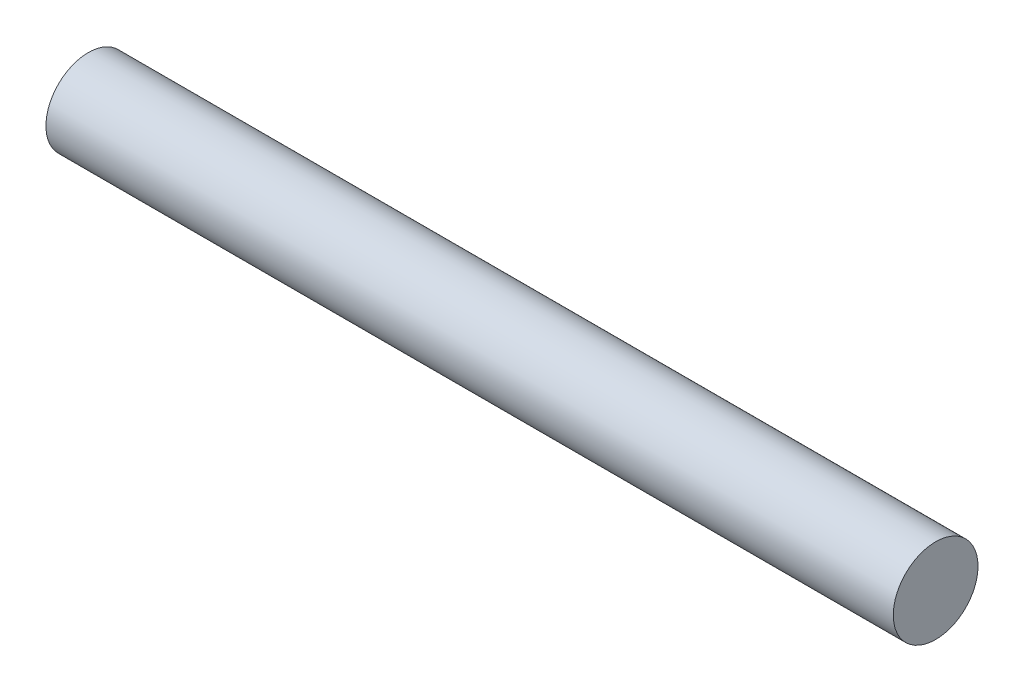
ISO-10303-21;
HEADER;
FILE_DESCRIPTION(('STEP AP214'),'2;1');
FILE_NAME('part.step','',(''),(''),'','','');
FILE_SCHEMA(('AUTOMOTIVE_DESIGN { 1 0 10303 214 1 1 1 1 }'));
ENDSEC;
DATA;
#1=APPLICATION_CONTEXT('core data for automotive mechanical design processes');
#2=APPLICATION_PROTOCOL_DEFINITION('international standard','automotive_design',2000,#1);
#3=PRODUCT_CONTEXT('',#1,'mechanical');
#4=PRODUCT('Part','Part','',(#3));
#5=PRODUCT_RELATED_PRODUCT_CATEGORY('part','',(#4));
#6=PRODUCT_DEFINITION_FORMATION('','',#4);
#7=PRODUCT_DEFINITION_CONTEXT('part definition',#1,'design');
#8=PRODUCT_DEFINITION('design','',#6,#7);
#9=PRODUCT_DEFINITION_SHAPE('','',#8);
#10=(LENGTH_UNIT() NAMED_UNIT(*) SI_UNIT(.MILLI.,.METRE.));
#11=(NAMED_UNIT(*) PLANE_ANGLE_UNIT() SI_UNIT($,.RADIAN.));
#12=(NAMED_UNIT(*) SI_UNIT($,.STERADIAN.) SOLID_ANGLE_UNIT());
#13=UNCERTAINTY_MEASURE_WITH_UNIT(LENGTH_MEASURE(1.E-05),#10,'distance_accuracy_value','');
#14=(GEOMETRIC_REPRESENTATION_CONTEXT(3) GLOBAL_UNCERTAINTY_ASSIGNED_CONTEXT((#13)) GLOBAL_UNIT_ASSIGNED_CONTEXT((#10,
#11,#12)) REPRESENTATION_CONTEXT('',''));
#15=CARTESIAN_POINT('',(0.,0.,0.));
#16=DIRECTION('',(0.,0.,1.));
#17=DIRECTION('',(1.,0.,0.));
#18=AXIS2_PLACEMENT_3D('',#15,#16,#17);
#19=CARTESIAN_POINT('',(50.,0.,0.));
#20=DIRECTION('',(-1.,0.,0.));
#21=DIRECTION('',(0.,0.,1.));
#22=AXIS2_PLACEMENT_3D('',#19,#20,#21);
#23=CYLINDRICAL_SURFACE('',#22,2.5);
#24=CARTESIAN_POINT('',(50.,0.,0.));
#25=DIRECTION('',(1.,0.,0.));
#26=DIRECTION('',(0.,0.,-1.));
#27=AXIS2_PLACEMENT_3D('',#24,#25,#26);
#28=CIRCLE('',#27,2.5);
#29=CARTESIAN_POINT('',(50.,0.,-2.5));
#30=VERTEX_POINT('',#29);
#31=EDGE_CURVE('E10',#30,#30,#28,.T.);
#32=ORIENTED_EDGE('',*,*,#31,.F.);
#33=EDGE_LOOP('',(#32));
#34=FACE_BOUND('',#33,.T.);
#35=CARTESIAN_POINT('',(0.,0.,0.));
#36=DIRECTION('',(1.,0.,0.));
#37=DIRECTION('',(0.,0.,-1.));
#38=AXIS2_PLACEMENT_3D('',#35,#36,#37);
#39=CIRCLE('',#38,2.5);
#40=CARTESIAN_POINT('',(0.,0.,-2.5));
#41=VERTEX_POINT('',#40);
#42=EDGE_CURVE('E36',#41,#41,#39,.T.);
#43=ORIENTED_EDGE('',*,*,#42,.T.);
#44=EDGE_LOOP('',(#43));
#45=FACE_BOUND('',#44,.T.);
#46=ADVANCED_FACE('F33',(#34,#45),#23,.T.);
#47=CARTESIAN_POINT('',(50.,0.,0.));
#48=DIRECTION('',(1.,0.,0.));
#49=DIRECTION('',(0.,0.,-1.));
#50=AXIS2_PLACEMENT_3D('',#47,#48,#49);
#51=PLANE('',#50);
#52=ORIENTED_EDGE('',*,*,#31,.T.);
#53=EDGE_LOOP('',(#52));
#54=FACE_BOUND('',#53,.T.);
#55=ADVANCED_FACE('F48',(#54),#51,.T.);
#56=CARTESIAN_POINT('',(0.,0.,0.));
#57=DIRECTION('',(1.,0.,0.));
#58=DIRECTION('',(0.,0.,-1.));
#59=AXIS2_PLACEMENT_3D('',#56,#57,#58);
#60=PLANE('',#59);
#61=ORIENTED_EDGE('',*,*,#42,.F.);
#62=EDGE_LOOP('',(#61));
#63=FACE_BOUND('',#62,.T.);
#64=ADVANCED_FACE('F46',(#63),#60,.F.);
#65=CLOSED_SHELL('',(#46,#55,#64));
#66=MANIFOLD_SOLID_BREP('B2',#65);
#67=ADVANCED_BREP_SHAPE_REPRESENTATION('',(#18,#66),#14);
#68=SHAPE_DEFINITION_REPRESENTATION(#9,#67);
ENDSEC;
END-ISO-10303-21;
